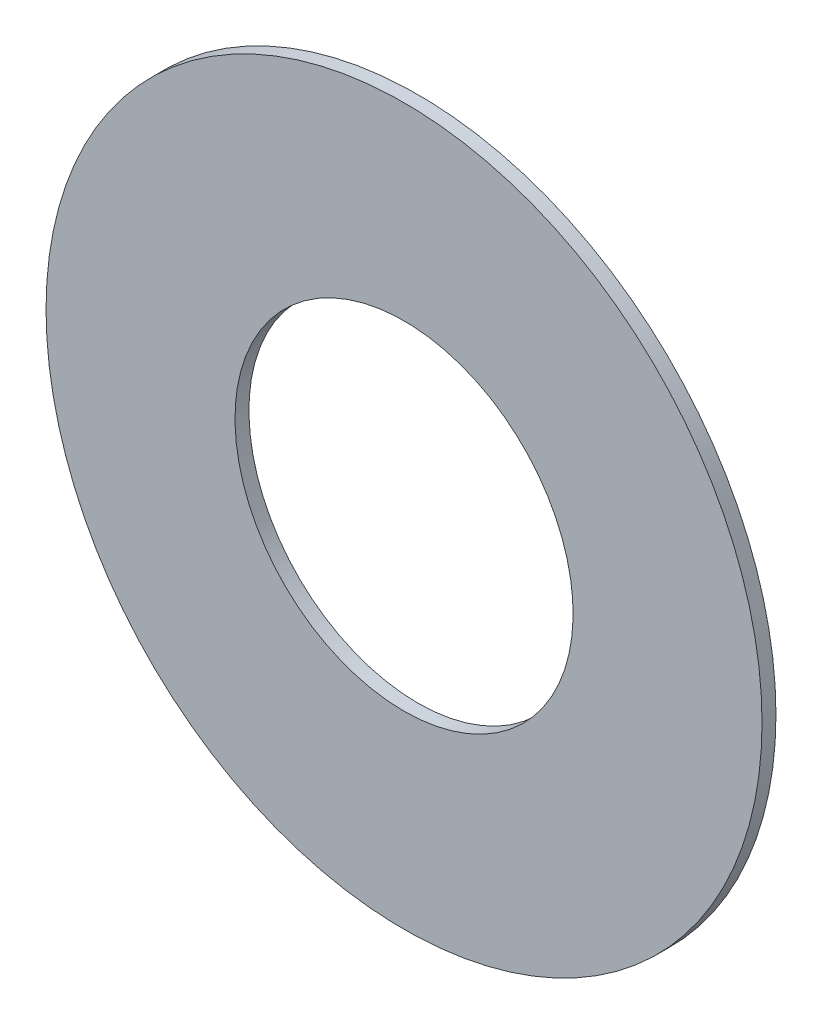
ISO-10303-21;
HEADER;
FILE_DESCRIPTION(('STEP AP214'),'2;1');
FILE_NAME('part.step','',(''),(''),'','','');
FILE_SCHEMA(('AUTOMOTIVE_DESIGN { 1 0 10303 214 1 1 1 1 }'));
ENDSEC;
DATA;
#1=APPLICATION_CONTEXT('core data for automotive mechanical design processes');
#2=APPLICATION_PROTOCOL_DEFINITION('international standard','automotive_design',2000,#1);
#3=PRODUCT_CONTEXT('',#1,'mechanical');
#4=PRODUCT('Part','Part','',(#3));
#5=PRODUCT_RELATED_PRODUCT_CATEGORY('part','',(#4));
#6=PRODUCT_DEFINITION_FORMATION('','',#4);
#7=PRODUCT_DEFINITION_CONTEXT('part definition',#1,'design');
#8=PRODUCT_DEFINITION('design','',#6,#7);
#9=PRODUCT_DEFINITION_SHAPE('','',#8);
#10=(LENGTH_UNIT() NAMED_UNIT(*) SI_UNIT(.MILLI.,.METRE.));
#11=(NAMED_UNIT(*) PLANE_ANGLE_UNIT() SI_UNIT($,.RADIAN.));
#12=(NAMED_UNIT(*) SI_UNIT($,.STERADIAN.) SOLID_ANGLE_UNIT());
#13=UNCERTAINTY_MEASURE_WITH_UNIT(LENGTH_MEASURE(1.E-05),#10,'distance_accuracy_value','');
#14=(GEOMETRIC_REPRESENTATION_CONTEXT(3) GLOBAL_UNCERTAINTY_ASSIGNED_CONTEXT((#13)) GLOBAL_UNIT_ASSIGNED_CONTEXT((#10,
#11,#12)) REPRESENTATION_CONTEXT('',''));
#15=CARTESIAN_POINT('',(0.,0.,0.));
#16=DIRECTION('',(0.,0.,1.));
#17=DIRECTION('',(1.,0.,0.));
#18=AXIS2_PLACEMENT_3D('',#15,#16,#17);
#19=CARTESIAN_POINT('',(117.1498,-71.2108,-0.045));
#20=DIRECTION('',(0.,0.,-1.));
#21=DIRECTION('',(0.,-1.,0.));
#22=AXIS2_PLACEMENT_3D('',#19,#20,#21);
#23=CYLINDRICAL_SURFACE('',#22,0.425);
#24=CARTESIAN_POINT('',(117.1498,-71.2108,-0.035));
#25=DIRECTION('',(0.,0.,-1.));
#26=DIRECTION('',(0.,-1.,0.));
#27=AXIS2_PLACEMENT_3D('',#24,#25,#26);
#28=CIRCLE('',#27,0.425);
#29=CARTESIAN_POINT('',(117.1498,-71.6358,-0.035));
#30=VERTEX_POINT('',#29);
#31=EDGE_CURVE('E25',#30,#30,#28,.T.);
#32=ORIENTED_EDGE('',*,*,#31,.T.);
#33=DIRECTION('',(0.,0.,1.));
#34=VECTOR('',#33,1.);
#35=CARTESIAN_POINT('',(117.1498,-71.6358,-0.045));
#36=LINE('',#35,#34);
#37=CARTESIAN_POINT('',(117.1498,-71.6358,0.));
#38=VERTEX_POINT('',#37);
#39=EDGE_CURVE('E11',#30,#38,#36,.T.);
#40=ORIENTED_EDGE('',*,*,#39,.T.);
#41=CARTESIAN_POINT('',(117.1498,-71.2108,0.));
#42=DIRECTION('',(0.,0.,-1.));
#43=DIRECTION('',(0.,-1.,0.));
#44=AXIS2_PLACEMENT_3D('',#41,#42,#43);
#45=CIRCLE('',#44,0.425);
#46=EDGE_CURVE('E68',#38,#38,#45,.T.);
#47=ORIENTED_EDGE('',*,*,#46,.F.);
#48=ORIENTED_EDGE('',*,*,#39,.F.);
#49=EDGE_LOOP('',(#32,#40,#47,#48));
#50=FACE_BOUND('',#49,.T.);
#51=ADVANCED_FACE('F17',(#50),#23,.F.);
#52=CARTESIAN_POINT('',(117.1498,-71.2108,-0.035));
#53=DIRECTION('',(0.,0.,1.));
#54=DIRECTION('',(1.,0.,0.));
#55=AXIS2_PLACEMENT_3D('',#52,#53,#54);
#56=PLANE('',#55);
#57=ORIENTED_EDGE('',*,*,#31,.F.);
#58=EDGE_LOOP('',(#57));
#59=FACE_BOUND('',#58,.T.);
#60=CARTESIAN_POINT('',(117.1498,-71.2108,-0.035));
#61=DIRECTION('',(0.,0.,1.));
#62=DIRECTION('',(1.,0.,0.));
#63=AXIS2_PLACEMENT_3D('',#60,#61,#62);
#64=CIRCLE('',#63,0.9);
#65=CARTESIAN_POINT('',(118.0498,-71.2108,-0.035));
#66=VERTEX_POINT('',#65);
#67=EDGE_CURVE('E56',#66,#66,#64,.T.);
#68=ORIENTED_EDGE('',*,*,#67,.F.);
#69=EDGE_LOOP('',(#68));
#70=FACE_BOUND('',#69,.T.);
#71=ADVANCED_FACE('F76',(#59,#70),#56,.F.);
#72=CARTESIAN_POINT('',(117.1498,-71.2108,0.));
#73=DIRECTION('',(0.,0.,1.));
#74=DIRECTION('',(1.,0.,0.));
#75=AXIS2_PLACEMENT_3D('',#72,#73,#74);
#76=PLANE('',#75);
#77=ORIENTED_EDGE('',*,*,#46,.T.);
#78=EDGE_LOOP('',(#77));
#79=FACE_BOUND('',#78,.T.);
#80=CARTESIAN_POINT('',(117.1498,-71.2108,0.));
#81=DIRECTION('',(0.,0.,1.));
#82=DIRECTION('',(1.,0.,0.));
#83=AXIS2_PLACEMENT_3D('',#80,#81,#82);
#84=CIRCLE('',#83,0.9);
#85=CARTESIAN_POINT('',(118.0498,-71.2108,0.));
#86=VERTEX_POINT('',#85);
#87=EDGE_CURVE('E54',#86,#86,#84,.T.);
#88=ORIENTED_EDGE('',*,*,#87,.T.);
#89=EDGE_LOOP('',(#88));
#90=FACE_BOUND('',#89,.T.);
#91=ADVANCED_FACE('F60',(#79,#90),#76,.T.);
#92=CARTESIAN_POINT('',(117.1498,-71.2108,-0.035));
#93=DIRECTION('',(0.,0.,1.));
#94=DIRECTION('',(1.,0.,0.));
#95=AXIS2_PLACEMENT_3D('',#92,#93,#94);
#96=CYLINDRICAL_SURFACE('',#95,0.9);
#97=ORIENTED_EDGE('',*,*,#87,.F.);
#98=DIRECTION('',(0.,0.,1.));
#99=VECTOR('',#98,1.);
#100=CARTESIAN_POINT('',(118.0498,-71.2108,-0.035));
#101=LINE('',#100,#99);
#102=EDGE_CURVE('E51',#66,#86,#101,.T.);
#103=ORIENTED_EDGE('',*,*,#102,.F.);
#104=ORIENTED_EDGE('',*,*,#67,.T.);
#105=ORIENTED_EDGE('',*,*,#102,.T.);
#106=EDGE_LOOP('',(#97,#103,#104,#105));
#107=FACE_BOUND('',#106,.T.);
#108=ADVANCED_FACE('F53',(#107),#96,.T.);
#109=CLOSED_SHELL('',(#51,#71,#91,#108));
#110=MANIFOLD_SOLID_BREP('B1',#109);
#111=ADVANCED_BREP_SHAPE_REPRESENTATION('',(#18,#110),#14);
#112=SHAPE_DEFINITION_REPRESENTATION(#9,#111);
ENDSEC;
END-ISO-10303-21;
